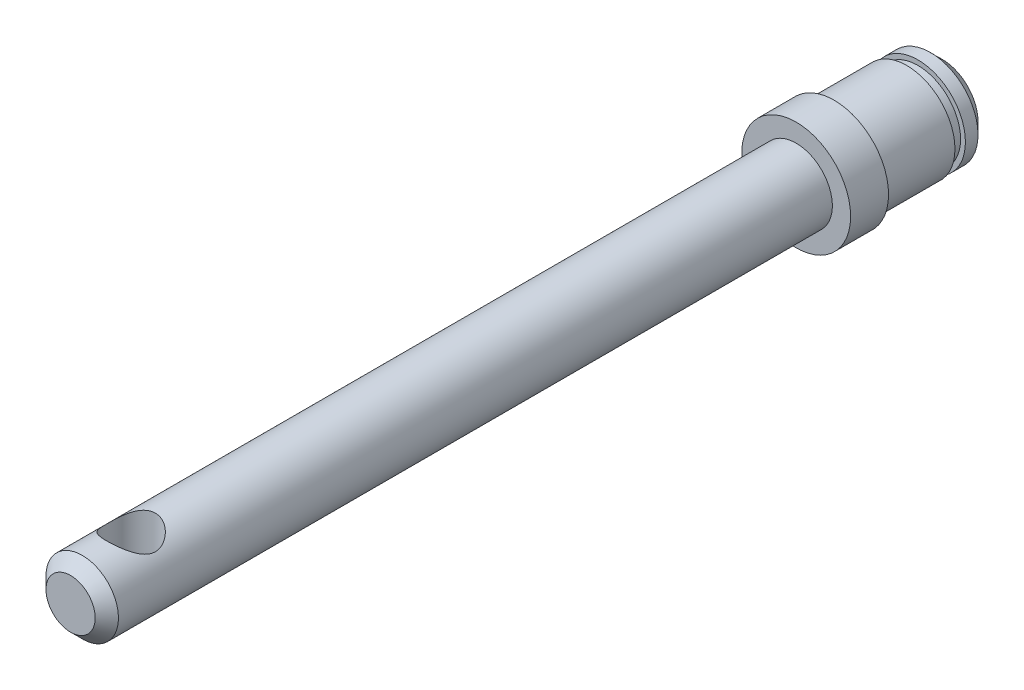
ISO-10303-21;
HEADER;
FILE_DESCRIPTION(('STEP AP214'),'2;1');
FILE_NAME('part.step','',(''),(''),'','','');
FILE_SCHEMA(('AUTOMOTIVE_DESIGN { 1 0 10303 214 1 1 1 1 }'));
ENDSEC;
DATA;
#1=APPLICATION_CONTEXT('core data for automotive mechanical design processes');
#2=APPLICATION_PROTOCOL_DEFINITION('international standard','automotive_design',2000,#1);
#3=PRODUCT_CONTEXT('',#1,'mechanical');
#4=PRODUCT('Part','Part','',(#3));
#5=PRODUCT_RELATED_PRODUCT_CATEGORY('part','',(#4));
#6=PRODUCT_DEFINITION_FORMATION('','',#4);
#7=PRODUCT_DEFINITION_CONTEXT('part definition',#1,'design');
#8=PRODUCT_DEFINITION('design','',#6,#7);
#9=PRODUCT_DEFINITION_SHAPE('','',#8);
#10=(LENGTH_UNIT() NAMED_UNIT(*) SI_UNIT(.MILLI.,.METRE.));
#11=(NAMED_UNIT(*) PLANE_ANGLE_UNIT() SI_UNIT($,.RADIAN.));
#12=(NAMED_UNIT(*) SI_UNIT($,.STERADIAN.) SOLID_ANGLE_UNIT());
#13=UNCERTAINTY_MEASURE_WITH_UNIT(LENGTH_MEASURE(1.E-05),#10,'distance_accuracy_value','');
#14=(GEOMETRIC_REPRESENTATION_CONTEXT(3) GLOBAL_UNCERTAINTY_ASSIGNED_CONTEXT((#13)) GLOBAL_UNIT_ASSIGNED_CONTEXT((#10,
#11,#12)) REPRESENTATION_CONTEXT('',''));
#15=CARTESIAN_POINT('',(0.,0.,0.));
#16=DIRECTION('',(0.,0.,1.));
#17=DIRECTION('',(1.,0.,0.));
#18=AXIS2_PLACEMENT_3D('',#15,#16,#17);
#19=CARTESIAN_POINT('',(0.,0.,-9.5758));
#20=DIRECTION('',(0.,0.,-1.));
#21=DIRECTION('',(-1.,0.,0.));
#22=AXIS2_PLACEMENT_3D('',#19,#20,#21);
#23=PLANE('',#22);
#24=CARTESIAN_POINT('',(0.,0.,-9.57579999993641));
#25=DIRECTION('',(0.,0.,1.));
#26=DIRECTION('',(1.,0.,0.));
#27=AXIS2_PLACEMENT_3D('',#24,#25,#26);
#28=CIRCLE('',#27,2.3494999999798);
#29=CARTESIAN_POINT('',(2.3494999999798,0.,-9.57579999993641));
#30=VERTEX_POINT('',#29);
#31=EDGE_CURVE('E17',#30,#30,#28,.T.);
#32=ORIENTED_EDGE('',*,*,#31,.F.);
#33=EDGE_LOOP('',(#32));
#34=FACE_BOUND('',#33,.T.);
#35=ADVANCED_FACE('F14',(#34),#23,.T.);
#36=CARTESIAN_POINT('',(0.,0.,-8.81380000009813));
#37=DIRECTION('',(0.,0.,1.));
#38=DIRECTION('',(1.,0.,0.));
#39=AXIS2_PLACEMENT_3D('',#36,#37,#38);
#40=CONICAL_SURFACE('',#39,3.11149999987492,0.785398163434747);
#41=ORIENTED_EDGE('',*,*,#31,.T.);
#42=EDGE_LOOP('',(#41));
#43=FACE_BOUND('',#42,.T.);
#44=CARTESIAN_POINT('',(0.,0.,-8.8138));
#45=DIRECTION('',(0.,0.,1.));
#46=DIRECTION('',(1.,0.,0.));
#47=AXIS2_PLACEMENT_3D('',#44,#45,#46);
#48=CIRCLE('',#47,3.1115);
#49=CARTESIAN_POINT('',(3.1115,0.,-8.8138));
#50=VERTEX_POINT('',#49);
#51=EDGE_CURVE('E33',#50,#50,#48,.T.);
#52=ORIENTED_EDGE('',*,*,#51,.F.);
#53=EDGE_LOOP('',(#52));
#54=FACE_BOUND('',#53,.T.);
#55=ADVANCED_FACE('F79',(#43,#54),#40,.T.);
#56=CARTESIAN_POINT('',(0.,0.,-9.5758));
#57=DIRECTION('',(0.,0.,1.));
#58=DIRECTION('',(1.,0.,0.));
#59=AXIS2_PLACEMENT_3D('',#56,#57,#58);
#60=CYLINDRICAL_SURFACE('',#59,3.1115);
#61=ORIENTED_EDGE('',*,*,#51,.T.);
#62=EDGE_LOOP('',(#61));
#63=FACE_BOUND('',#62,.T.);
#64=CARTESIAN_POINT('',(0.,0.,-7.9883));
#65=DIRECTION('',(0.,0.,1.));
#66=DIRECTION('',(1.,0.,0.));
#67=AXIS2_PLACEMENT_3D('',#64,#65,#66);
#68=CIRCLE('',#67,3.1115);
#69=CARTESIAN_POINT('',(3.1115,0.,-7.9883));
#70=VERTEX_POINT('',#69);
#71=EDGE_CURVE('E69',#70,#70,#68,.F.);
#72=ORIENTED_EDGE('',*,*,#71,.T.);
#73=EDGE_LOOP('',(#72));
#74=FACE_BOUND('',#73,.T.);
#75=ADVANCED_FACE('F87',(#63,#74),#60,.T.);
#76=CARTESIAN_POINT('',(0.,0.,-7.9883));
#77=DIRECTION('',(0.,0.,-1.));
#78=DIRECTION('',(-1.,0.,0.));
#79=AXIS2_PLACEMENT_3D('',#76,#77,#78);
#80=PLANE('',#79);
#81=CARTESIAN_POINT('',(0.,0.,-7.9883));
#82=DIRECTION('',(0.,0.,1.));
#83=DIRECTION('',(1.,0.,0.));
#84=AXIS2_PLACEMENT_3D('',#81,#82,#83);
#85=CIRCLE('',#84,2.794);
#86=CARTESIAN_POINT('',(2.794,0.,-7.9883));
#87=VERTEX_POINT('',#86);
#88=EDGE_CURVE('E67',#87,#87,#85,.T.);
#89=ORIENTED_EDGE('',*,*,#88,.F.);
#90=EDGE_LOOP('',(#89));
#91=FACE_BOUND('',#90,.T.);
#92=ORIENTED_EDGE('',*,*,#71,.F.);
#93=EDGE_LOOP('',(#92));
#94=FACE_BOUND('',#93,.T.);
#95=ADVANCED_FACE('F92',(#91,#94),#80,.F.);
#96=CARTESIAN_POINT('',(0.,0.,-7.9883));
#97=DIRECTION('',(0.,0.,1.));
#98=DIRECTION('',(1.,0.,0.));
#99=AXIS2_PLACEMENT_3D('',#96,#97,#98);
#100=CYLINDRICAL_SURFACE('',#99,2.794);
#101=CARTESIAN_POINT('',(0.,0.,-7.2517));
#102=DIRECTION('',(0.,0.,1.));
#103=DIRECTION('',(1.,0.,0.));
#104=AXIS2_PLACEMENT_3D('',#101,#102,#103);
#105=CIRCLE('',#104,2.794);
#106=CARTESIAN_POINT('',(2.794,0.,-7.2517));
#107=VERTEX_POINT('',#106);
#108=EDGE_CURVE('E64',#107,#107,#105,.T.);
#109=ORIENTED_EDGE('',*,*,#108,.F.);
#110=EDGE_LOOP('',(#109));
#111=FACE_BOUND('',#110,.T.);
#112=ORIENTED_EDGE('',*,*,#88,.T.);
#113=EDGE_LOOP('',(#112));
#114=FACE_BOUND('',#113,.T.);
#115=ADVANCED_FACE('F97',(#111,#114),#100,.T.);
#116=CARTESIAN_POINT('',(0.,0.,-7.2517));
#117=DIRECTION('',(0.,0.,-1.));
#118=DIRECTION('',(-1.,0.,0.));
#119=AXIS2_PLACEMENT_3D('',#116,#117,#118);
#120=PLANE('',#119);
#121=ORIENTED_EDGE('',*,*,#108,.T.);
#122=EDGE_LOOP('',(#121));
#123=FACE_BOUND('',#122,.T.);
#124=CARTESIAN_POINT('',(0.,0.,-7.2517));
#125=DIRECTION('',(0.,0.,1.));
#126=DIRECTION('',(1.,0.,0.));
#127=AXIS2_PLACEMENT_3D('',#124,#125,#126);
#128=CIRCLE('',#127,3.1623);
#129=CARTESIAN_POINT('',(3.1623,0.,-7.2517));
#130=VERTEX_POINT('',#129);
#131=EDGE_CURVE('E61',#130,#130,#128,.T.);
#132=ORIENTED_EDGE('',*,*,#131,.F.);
#133=EDGE_LOOP('',(#132));
#134=FACE_BOUND('',#133,.T.);
#135=ADVANCED_FACE('F101',(#123,#134),#120,.T.);
#136=CARTESIAN_POINT('',(0.,0.,-7.2517));
#137=DIRECTION('',(0.,0.,1.));
#138=DIRECTION('',(1.,0.,0.));
#139=AXIS2_PLACEMENT_3D('',#136,#137,#138);
#140=CYLINDRICAL_SURFACE('',#139,3.1623);
#141=ORIENTED_EDGE('',*,*,#131,.T.);
#142=EDGE_LOOP('',(#141));
#143=FACE_BOUND('',#142,.T.);
#144=CARTESIAN_POINT('',(0.,0.,-2.4892));
#145=DIRECTION('',(0.,0.,1.));
#146=DIRECTION('',(1.,0.,0.));
#147=AXIS2_PLACEMENT_3D('',#144,#145,#146);
#148=CIRCLE('',#147,3.1623);
#149=CARTESIAN_POINT('',(3.1623,0.,-2.4892));
#150=VERTEX_POINT('',#149);
#151=EDGE_CURVE('E58',#150,#150,#148,.F.);
#152=ORIENTED_EDGE('',*,*,#151,.T.);
#153=EDGE_LOOP('',(#152));
#154=FACE_BOUND('',#153,.T.);
#155=ADVANCED_FACE('F105',(#143,#154),#140,.T.);
#156=CARTESIAN_POINT('',(0.,0.,-2.4892));
#157=DIRECTION('',(0.,0.,1.));
#158=DIRECTION('',(1.,0.,0.));
#159=AXIS2_PLACEMENT_3D('',#156,#157,#158);
#160=PLANE('',#159);
#161=ORIENTED_EDGE('',*,*,#151,.F.);
#162=EDGE_LOOP('',(#161));
#163=FACE_BOUND('',#162,.T.);
#164=CARTESIAN_POINT('',(0.,0.,-2.4892));
#165=DIRECTION('',(0.,0.,1.));
#166=DIRECTION('',(1.,0.,0.));
#167=AXIS2_PLACEMENT_3D('',#164,#165,#166);
#168=CIRCLE('',#167,3.571875);
#169=CARTESIAN_POINT('',(3.571875,0.,-2.4892));
#170=VERTEX_POINT('',#169);
#171=EDGE_CURVE('E55',#170,#170,#168,.T.);
#172=ORIENTED_EDGE('',*,*,#171,.F.);
#173=EDGE_LOOP('',(#172));
#174=FACE_BOUND('',#173,.T.);
#175=ADVANCED_FACE('F109',(#163,#174),#160,.F.);
#176=CARTESIAN_POINT('',(0.,0.,47.5742));
#177=DIRECTION('',(0.,0.,1.));
#178=DIRECTION('',(1.,0.,0.));
#179=AXIS2_PLACEMENT_3D('',#176,#177,#178);
#180=PLANE('',#179);
#181=CARTESIAN_POINT('',(0.,0.,47.5741999999855));
#182=DIRECTION('',(0.,0.,-1.));
#183=DIRECTION('',(-1.,0.,0.));
#184=AXIS2_PLACEMENT_3D('',#181,#182,#183);
#185=CIRCLE('',#184,1.61289999999781);
#186=CARTESIAN_POINT('',(-1.61289999999781,0.,47.5741999999855));
#187=VERTEX_POINT('',#186);
#188=EDGE_CURVE('E52',#187,#187,#185,.T.);
#189=ORIENTED_EDGE('',*,*,#188,.F.);
#190=EDGE_LOOP('',(#189));
#191=FACE_BOUND('',#190,.T.);
#192=ADVANCED_FACE('F113',(#191),#180,.T.);
#193=CARTESIAN_POINT('',(0.,0.,-2.4892));
#194=DIRECTION('',(0.,0.,1.));
#195=DIRECTION('',(1.,0.,0.));
#196=AXIS2_PLACEMENT_3D('',#193,#194,#195);
#197=CYLINDRICAL_SURFACE('',#196,3.571875);
#198=ORIENTED_EDGE('',*,*,#171,.T.);
#199=EDGE_LOOP('',(#198));
#200=FACE_BOUND('',#199,.T.);
#201=CARTESIAN_POINT('',(0.,0.,0.));
#202=DIRECTION('',(0.,0.,1.));
#203=DIRECTION('',(1.,0.,0.));
#204=AXIS2_PLACEMENT_3D('',#201,#202,#203);
#205=CIRCLE('',#204,3.571875);
#206=CARTESIAN_POINT('',(3.571875,0.,0.));
#207=VERTEX_POINT('',#206);
#208=EDGE_CURVE('E49',#207,#207,#205,.T.);
#209=ORIENTED_EDGE('',*,*,#208,.F.);
#210=EDGE_LOOP('',(#209));
#211=FACE_BOUND('',#210,.T.);
#212=ADVANCED_FACE('F117',(#200,#211),#197,.T.);
#213=CARTESIAN_POINT('',(0.,0.,46.8121999999767));
#214=DIRECTION('',(0.,0.,-1.));
#215=DIRECTION('',(-1.,0.,0.));
#216=AXIS2_PLACEMENT_3D('',#213,#214,#215);
#217=CONICAL_SURFACE('',#216,2.37490000000662,0.785398163397448);
#218=ORIENTED_EDGE('',*,*,#188,.T.);
#219=EDGE_LOOP('',(#218));
#220=FACE_BOUND('',#219,.T.);
#221=CARTESIAN_POINT('',(0.,0.,46.8122));
#222=DIRECTION('',(0.,0.,-1.));
#223=DIRECTION('',(-1.,0.,0.));
#224=AXIS2_PLACEMENT_3D('',#221,#222,#223);
#225=CIRCLE('',#224,2.3749);
#226=CARTESIAN_POINT('',(-2.3749,0.,46.8122));
#227=VERTEX_POINT('',#226);
#228=EDGE_CURVE('E26',#227,#227,#225,.T.);
#229=ORIENTED_EDGE('',*,*,#228,.F.);
#230=EDGE_LOOP('',(#229));
#231=FACE_BOUND('',#230,.T.);
#232=ADVANCED_FACE('F121',(#220,#231),#217,.T.);
#233=CARTESIAN_POINT('',(0.,0.,0.));
#234=DIRECTION('',(0.,0.,1.));
#235=DIRECTION('',(1.,0.,0.));
#236=AXIS2_PLACEMENT_3D('',#233,#234,#235);
#237=PLANE('',#236);
#238=CARTESIAN_POINT('',(0.,0.,0.));
#239=DIRECTION('',(0.,0.,-1.));
#240=DIRECTION('',(-1.,0.,0.));
#241=AXIS2_PLACEMENT_3D('',#238,#239,#240);
#242=CIRCLE('',#241,2.3749);
#243=CARTESIAN_POINT('',(-2.3749,0.,0.));
#244=VERTEX_POINT('',#243);
#245=EDGE_CURVE('E21',#244,#244,#242,.F.);
#246=ORIENTED_EDGE('',*,*,#245,.F.);
#247=EDGE_LOOP('',(#246));
#248=FACE_BOUND('',#247,.T.);
#249=ORIENTED_EDGE('',*,*,#208,.T.);
#250=EDGE_LOOP('',(#249));
#251=FACE_BOUND('',#250,.T.);
#252=ADVANCED_FACE('F124',(#248,#251),#237,.T.);
#253=CARTESIAN_POINT('',(0.,-3.571875,43.60545));
#254=DIRECTION('',(0.,1.,0.));
#255=DIRECTION('',(0.,0.,1.));
#256=AXIS2_PLACEMENT_3D('',#253,#254,#255);
#257=CYLINDRICAL_SURFACE('',#256,1.5875);
#258=CARTESIAN_POINT('',(0.,2.3749,45.19295));
#259=CARTESIAN_POINT('',(-0.0796285021727966,2.37489427166207,45.1929439134093));
#260=CARTESIAN_POINT('',(-0.159333187346092,2.3708547437601,45.1869178453679));
#261=CARTESIAN_POINT('',(-0.316246788253907,2.35507625489168,45.1631617849446));
#262=CARTESIAN_POINT('',(-0.393451638249593,2.34332535323937,45.1454136412255));
#263=CARTESIAN_POINT('',(-0.542790518515763,2.31328830758023,45.0993083312295));
#264=CARTESIAN_POINT('',(-0.614948378456795,2.29503576257873,45.0710056736267));
#265=CARTESIAN_POINT('',(-0.753178545236462,2.25346165524091,45.0050040485006));
#266=CARTESIAN_POINT('',(-0.819251194999285,2.23014037879558,44.9673056109087));
#267=CARTESIAN_POINT('',(-0.949807131451189,2.17792784028168,44.8800881288627));
#268=CARTESIAN_POINT('',(-1.01367601133952,2.14873138397025,44.8298358883516));
#269=CARTESIAN_POINT('',(-1.13266066753279,2.0884656766868,44.7206931180195));
#270=CARTESIAN_POINT('',(-1.18776336726205,2.05739372150985,44.6617899306125));
#271=CARTESIAN_POINT('',(-1.29659427145063,1.99089626995362,44.5261680967343));
#272=CARTESIAN_POINT('',(-1.34871636553572,1.95556248733199,44.4481056626616));
#273=CARTESIAN_POINT('',(-1.43904349853149,1.89008374794265,44.2823403381314));
#274=CARTESIAN_POINT('',(-1.4772725865024,1.85992987284409,44.1946544520516));
#275=CARTESIAN_POINT('',(-1.52904517834333,1.81740283377534,44.0377472795276));
#276=CARTESIAN_POINT('',(-1.54653236351236,1.80240921282223,43.9705447171603));
#277=CARTESIAN_POINT('',(-1.57261168441343,1.77970474695812,43.8332848433952));
#278=CARTESIAN_POINT('',(-1.58121930044462,1.7719812296935,43.763232722255));
#279=CARTESIAN_POINT('',(-1.58899802612375,1.76501215254764,43.6218716388384));
#280=CARTESIAN_POINT('',(-1.58812985724121,1.76580188116326,43.5505586693621));
#281=CARTESIAN_POINT('',(-1.57692650593038,1.77581049841768,43.4092572197684));
#282=CARTESIAN_POINT('',(-1.56658327442516,1.7850365537139,43.3392699174096));
#283=CARTESIAN_POINT('',(-1.53778680769931,1.80988877384798,43.2056567626746));
#284=CARTESIAN_POINT('',(-1.51972103829905,1.82520699487101,43.1418863605764));
#285=CARTESIAN_POINT('',(-1.47635800673587,1.86045582345457,43.0182351850859));
#286=CARTESIAN_POINT('',(-1.45105836975688,1.88038794530891,42.9583556969829));
#287=CARTESIAN_POINT('',(-1.38804369169894,1.92751840139636,42.8311724358925));
#288=CARTESIAN_POINT('',(-1.34884877883874,1.95536954816995,42.7648460457442));
#289=CARTESIAN_POINT('',(-1.26169992826936,2.01270750683002,42.6389401049234));
#290=CARTESIAN_POINT('',(-1.21373539144903,2.04219626760565,42.5793688613398));
#291=CARTESIAN_POINT('',(-1.09822042057742,2.10697571698643,42.4553504562286));
#292=CARTESIAN_POINT('',(-1.02867941502371,2.14213147691545,42.3926663982129));
#293=CARTESIAN_POINT('',(-0.87829590652397,2.20804612806214,42.2797162875604));
#294=CARTESIAN_POINT('',(-0.797461070213304,2.23880797360637,42.2294418743602));
#295=CARTESIAN_POINT('',(-0.642794196366182,2.28740091649053,42.151857840345));
#296=CARTESIAN_POINT('',(-0.570673934887535,2.30658392602361,42.1219812810788));
#297=CARTESIAN_POINT('',(-0.421590346714549,2.33841465201831,42.0729550712348));
#298=CARTESIAN_POINT('',(-0.344638477425361,2.35107721947041,42.05378103609));
#299=CARTESIAN_POINT('',(-0.222529004084351,2.36486476954346,42.0329936390966));
#300=CARTESIAN_POINT('',(-0.178308116016056,2.36861511899109,42.0273651451537));
#301=CARTESIAN_POINT('',(-0.0893995612791168,2.37363462559172,42.0198411908061));
#302=CARTESIAN_POINT('',(-0.0447117904210668,2.37490321648955,42.0179465823498));
#303=CARTESIAN_POINT('',(0.0796285021727959,2.37489427166207,42.0179560865907));
#304=CARTESIAN_POINT('',(0.159333187346092,2.3708547437601,42.0239821546321));
#305=CARTESIAN_POINT('',(0.316246788253906,2.35507625489168,42.0477382150553));
#306=CARTESIAN_POINT('',(0.393451638249593,2.34332535323937,42.0654863587745));
#307=CARTESIAN_POINT('',(0.542790518515763,2.31328830758023,42.1115916687705));
#308=CARTESIAN_POINT('',(0.614948378456795,2.29503576257873,42.1398943263733));
#309=CARTESIAN_POINT('',(0.753178545236463,2.25346165524091,42.2058959514994));
#310=CARTESIAN_POINT('',(0.819251194999285,2.23014037879558,42.2435943890913));
#311=CARTESIAN_POINT('',(0.949807131451189,2.17792784028168,42.3308118711373));
#312=CARTESIAN_POINT('',(1.01367601133952,2.14873138397025,42.3810641116484));
#313=CARTESIAN_POINT('',(1.13266066753279,2.0884656766868,42.4902068819805));
#314=CARTESIAN_POINT('',(1.18776336726205,2.05739372150985,42.5491100693874));
#315=CARTESIAN_POINT('',(1.29659427145063,1.99089626995362,42.6847319032657));
#316=CARTESIAN_POINT('',(1.34871636553572,1.95556248733199,42.7627943373384));
#317=CARTESIAN_POINT('',(1.43904349853149,1.89008374794265,42.9285596618686));
#318=CARTESIAN_POINT('',(1.4772725865024,1.85992987284409,43.0162455479484));
#319=CARTESIAN_POINT('',(1.52904517834333,1.81740283377534,43.1731527204724));
#320=CARTESIAN_POINT('',(1.54653236351236,1.80240921282223,43.2403552828397));
#321=CARTESIAN_POINT('',(1.57261168441343,1.77970474695812,43.3776151566048));
#322=CARTESIAN_POINT('',(1.58121930044462,1.7719812296935,43.447667277745));
#323=CARTESIAN_POINT('',(1.58899802612375,1.76501215254764,43.5890283611616));
#324=CARTESIAN_POINT('',(1.58812985724121,1.76580188116326,43.6603413306379));
#325=CARTESIAN_POINT('',(1.57692650593038,1.77581049841768,43.8016427802316));
#326=CARTESIAN_POINT('',(1.56658327442517,1.7850365537139,43.8716300825904));
#327=CARTESIAN_POINT('',(1.53778680769931,1.80988877384798,44.0052432373254));
#328=CARTESIAN_POINT('',(1.51972103829905,1.825206994871,44.0690136394236));
#329=CARTESIAN_POINT('',(1.47635800673587,1.86045582345457,44.192664814914));
#330=CARTESIAN_POINT('',(1.45105836975689,1.88038794530891,44.2525443030171));
#331=CARTESIAN_POINT('',(1.38804369169894,1.92751840139636,44.3797275641075));
#332=CARTESIAN_POINT('',(1.34884877883874,1.95536954816995,44.4460539542558));
#333=CARTESIAN_POINT('',(1.26169992826936,2.01270750683002,44.5719598950766));
#334=CARTESIAN_POINT('',(1.21373539144903,2.04219626760564,44.6315311386602));
#335=CARTESIAN_POINT('',(1.09822042057742,2.10697571698643,44.7555495437714));
#336=CARTESIAN_POINT('',(1.02867941502371,2.14213147691544,44.8182336017871));
#337=CARTESIAN_POINT('',(0.87829590652398,2.20804612806214,44.9311837124396));
#338=CARTESIAN_POINT('',(0.797461070213316,2.23880797360636,44.9814581256398));
#339=CARTESIAN_POINT('',(0.642794196366197,2.28740091649053,45.059042159655));
#340=CARTESIAN_POINT('',(0.57067393488755,2.30658392602361,45.0889187189212));
#341=CARTESIAN_POINT('',(0.421590346714565,2.33841465201831,45.1379449287651));
#342=CARTESIAN_POINT('',(0.344638477425378,2.3510772194704,45.15711896391));
#343=CARTESIAN_POINT('',(0.222529004084365,2.36486476954346,45.1779063609034));
#344=CARTESIAN_POINT('',(0.178308116016067,2.36861511899109,45.1835348548463));
#345=CARTESIAN_POINT('',(0.0893995612791212,2.37363462559172,45.1910588091939));
#346=CARTESIAN_POINT('',(0.0447117904210687,2.37490321648955,45.1929534176502));
#347=CARTESIAN_POINT('',(0.,2.3749,45.19295));
#348=B_SPLINE_CURVE_WITH_KNOTS('',3,(#258,#259,#260,#261,#262,#263,#264,#265,#266,#267,#268,
#269,#270,#271,#272,#273,#274,#275,#276,#277,#278,#279,#280,#281,#282,#283,#284,#285,#286,#287,
#288,#289,#290,#291,#292,#293,#294,#295,#296,#297,#298,#299,#300,#301,#302,#303,#304,#305,#306,
#307,#308,#309,#310,#311,#312,#313,#314,#315,#316,#317,#318,#319,#320,#321,#322,#323,#324,#325,
#326,#327,#328,#329,#330,#331,#332,#333,#334,#335,#336,#337,#338,#339,#340,#341,#342,#343,#344,
#345,#346,#347),.UNSPECIFIED.,.T.,.F.,(4,2,2,2,2,2,2,2,2,2,2,2,2,2,2,2,2,2,2,2,2,2,2,2,2,2,2,2,
2,2,2,2,2,2,2,2,2,2,2,2,2,2,2,2,4),(0.,0.238700395852421,0.477771282535445,0.71562421428543,
0.95346373392742,1.21155549797826,1.47002872073382,1.76952408912618,2.06849852769238,
2.28077891750231,2.49268859719911,2.70547700634111,2.9184463472867,3.12179507761272,
3.32521064236503,3.57012288877609,3.815333120713,4.1139409115089,4.41234697329097,
4.65252034508975,4.89214425005817,5.02614510978654,5.16017654051243,5.39887693636485,
5.63794782304788,5.87580075479786,6.11364027443985,6.37173203849069,6.63020526124625,
6.92970062963861,7.22867506820481,7.44095545801474,7.65286513771153,7.86565354685354,
8.07862288779913,8.28197161812515,8.48538718287745,8.73029942928851,8.97550966122542,
9.27411745202132,9.57252351380338,9.81269688560216,10.0523207905706,10.186321650299,
10.3203530810249),.UNSPECIFIED.);
#349=CARTESIAN_POINT('',(0.,2.3749,45.19295));
#350=VERTEX_POINT('',#349);
#351=EDGE_CURVE('E44',#350,#350,#348,.T.);
#352=ORIENTED_EDGE('',*,*,#351,.F.);
#353=EDGE_LOOP('',(#352));
#354=FACE_BOUND('',#353,.T.);
#355=CARTESIAN_POINT('',(0.,-2.3749,45.19295));
#356=CARTESIAN_POINT('',(0.079628502172797,-2.37489427166208,45.1929439134093));
#357=CARTESIAN_POINT('',(0.159333187346093,-2.3708547437601,45.1869178453679));
#358=CARTESIAN_POINT('',(0.316246788253907,-2.35507625489168,45.1631617849446));
#359=CARTESIAN_POINT('',(0.393451638249594,-2.34332535323937,45.1454136412255));
#360=CARTESIAN_POINT('',(0.542790518515763,-2.31328830758023,45.0993083312295));
#361=CARTESIAN_POINT('',(0.614948378456796,-2.29503576257873,45.0710056736267));
#362=CARTESIAN_POINT('',(0.753178545236462,-2.25346165524091,45.0050040485006));
#363=CARTESIAN_POINT('',(0.819251194999285,-2.23014037879558,44.9673056109087));
#364=CARTESIAN_POINT('',(0.949807131451189,-2.17792784028168,44.8800881288627));
#365=CARTESIAN_POINT('',(1.01367601133952,-2.14873138397025,44.8298358883516));
#366=CARTESIAN_POINT('',(1.13266066753279,-2.0884656766868,44.7206931180195));
#367=CARTESIAN_POINT('',(1.18776336726205,-2.05739372150985,44.6617899306125));
#368=CARTESIAN_POINT('',(1.29659427145063,-1.99089626995362,44.5261680967343));
#369=CARTESIAN_POINT('',(1.34871636553572,-1.95556248733199,44.4481056626616));
#370=CARTESIAN_POINT('',(1.43904349853149,-1.89008374794265,44.2823403381314));
#371=CARTESIAN_POINT('',(1.4772725865024,-1.85992987284409,44.1946544520516));
#372=CARTESIAN_POINT('',(1.52904517834333,-1.81740283377534,44.0377472795276));
#373=CARTESIAN_POINT('',(1.54653236351237,-1.80240921282223,43.9705447171602));
#374=CARTESIAN_POINT('',(1.57261168441344,-1.77970474695812,43.8332848433952));
#375=CARTESIAN_POINT('',(1.58121930044462,-1.7719812296935,43.763232722255));
#376=CARTESIAN_POINT('',(1.58899802612375,-1.76501215254764,43.6218716388384));
#377=CARTESIAN_POINT('',(1.58812985724121,-1.76580188116326,43.5505586693621));
#378=CARTESIAN_POINT('',(1.57692650593038,-1.77581049841768,43.4092572197684));
#379=CARTESIAN_POINT('',(1.56658327442516,-1.7850365537139,43.3392699174096));
#380=CARTESIAN_POINT('',(1.53778680769931,-1.80988877384798,43.2056567626746));
#381=CARTESIAN_POINT('',(1.51972103829905,-1.82520699487101,43.1418863605764));
#382=CARTESIAN_POINT('',(1.47635800673587,-1.86045582345457,43.0182351850859));
#383=CARTESIAN_POINT('',(1.45105836975688,-1.88038794530891,42.9583556969829));
#384=CARTESIAN_POINT('',(1.38804369169894,-1.92751840139636,42.8311724358925));
#385=CARTESIAN_POINT('',(1.34884877883874,-1.95536954816995,42.7648460457442));
#386=CARTESIAN_POINT('',(1.26169992826936,-2.01270750683002,42.6389401049234));
#387=CARTESIAN_POINT('',(1.21373539144903,-2.04219626760565,42.5793688613398));
#388=CARTESIAN_POINT('',(1.09822042057742,-2.10697571698643,42.4553504562286));
#389=CARTESIAN_POINT('',(1.0286794150237,-2.14213147691545,42.3926663982129));
#390=CARTESIAN_POINT('',(0.878295906523966,-2.20804612806214,42.2797162875604));
#391=CARTESIAN_POINT('',(0.797461070213302,-2.23880797360637,42.2294418743602));
#392=CARTESIAN_POINT('',(0.642794196366183,-2.28740091649053,42.151857840345));
#393=CARTESIAN_POINT('',(0.570673934887537,-2.30658392602361,42.1219812810788));
#394=CARTESIAN_POINT('',(0.421590346714551,-2.33841465201831,42.0729550712348));
#395=CARTESIAN_POINT('',(0.344638477425362,-2.35107721947041,42.05378103609));
#396=CARTESIAN_POINT('',(0.22252900408435,-2.36486476954346,42.0329936390966));
#397=CARTESIAN_POINT('',(0.178308116016056,-2.36861511899109,42.0273651451537));
#398=CARTESIAN_POINT('',(0.0893995612791169,-2.37363462559172,42.0198411908061));
#399=CARTESIAN_POINT('',(0.0447117904210671,-2.37490321648955,42.0179465823498));
#400=CARTESIAN_POINT('',(-0.0796285021727957,-2.37489427166208,42.0179560865907));
#401=CARTESIAN_POINT('',(-0.159333187346092,-2.3708547437601,42.0239821546321));
#402=CARTESIAN_POINT('',(-0.316246788253906,-2.35507625489168,42.0477382150553));
#403=CARTESIAN_POINT('',(-0.393451638249593,-2.34332535323937,42.0654863587745));
#404=CARTESIAN_POINT('',(-0.542790518515762,-2.31328830758023,42.1115916687705));
#405=CARTESIAN_POINT('',(-0.614948378456795,-2.29503576257873,42.1398943263733));
#406=CARTESIAN_POINT('',(-0.753178545236462,-2.25346165524091,42.2058959514994));
#407=CARTESIAN_POINT('',(-0.819251194999284,-2.23014037879558,42.2435943890913));
#408=CARTESIAN_POINT('',(-0.949807131451189,-2.17792784028168,42.3308118711373));
#409=CARTESIAN_POINT('',(-1.01367601133952,-2.14873138397025,42.3810641116484));
#410=CARTESIAN_POINT('',(-1.13266066753279,-2.0884656766868,42.4902068819805));
#411=CARTESIAN_POINT('',(-1.18776336726205,-2.05739372150985,42.5491100693874));
#412=CARTESIAN_POINT('',(-1.29659427145063,-1.99089626995362,42.6847319032657));
#413=CARTESIAN_POINT('',(-1.34871636553572,-1.95556248733199,42.7627943373384));
#414=CARTESIAN_POINT('',(-1.43904349853149,-1.89008374794265,42.9285596618686));
#415=CARTESIAN_POINT('',(-1.4772725865024,-1.85992987284409,43.0162455479484));
#416=CARTESIAN_POINT('',(-1.52904517834333,-1.81740283377534,43.1731527204724));
#417=CARTESIAN_POINT('',(-1.54653236351237,-1.80240921282223,43.2403552828398));
#418=CARTESIAN_POINT('',(-1.57261168441344,-1.77970474695812,43.3776151566048));
#419=CARTESIAN_POINT('',(-1.58121930044462,-1.7719812296935,43.447667277745));
#420=CARTESIAN_POINT('',(-1.58899802612375,-1.76501215254764,43.5890283611616));
#421=CARTESIAN_POINT('',(-1.58812985724121,-1.76580188116326,43.6603413306379));
#422=CARTESIAN_POINT('',(-1.57692650593038,-1.77581049841768,43.8016427802316));
#423=CARTESIAN_POINT('',(-1.56658327442516,-1.7850365537139,43.8716300825904));
#424=CARTESIAN_POINT('',(-1.53778680769931,-1.80988877384798,44.0052432373254));
#425=CARTESIAN_POINT('',(-1.51972103829905,-1.82520699487101,44.0690136394236));
#426=CARTESIAN_POINT('',(-1.47635800673587,-1.86045582345457,44.192664814914));
#427=CARTESIAN_POINT('',(-1.45105836975688,-1.88038794530891,44.2525443030171));
#428=CARTESIAN_POINT('',(-1.38804369169894,-1.92751840139636,44.3797275641075));
#429=CARTESIAN_POINT('',(-1.34884877883874,-1.95536954816995,44.4460539542558));
#430=CARTESIAN_POINT('',(-1.26169992826936,-2.01270750683002,44.5719598950766));
#431=CARTESIAN_POINT('',(-1.21373539144903,-2.04219626760565,44.6315311386602));
#432=CARTESIAN_POINT('',(-1.09822042057742,-2.10697571698643,44.7555495437714));
#433=CARTESIAN_POINT('',(-1.02867941502371,-2.14213147691544,44.8182336017871));
#434=CARTESIAN_POINT('',(-0.878295906523972,-2.20804612806214,44.9311837124396));
#435=CARTESIAN_POINT('',(-0.797461070213305,-2.23880797360637,44.9814581256398));
#436=CARTESIAN_POINT('',(-0.642794196366183,-2.28740091649053,45.059042159655));
#437=CARTESIAN_POINT('',(-0.570673934887537,-2.30658392602361,45.0889187189212));
#438=CARTESIAN_POINT('',(-0.421590346714551,-2.33841465201831,45.1379449287651));
#439=CARTESIAN_POINT('',(-0.344638477425362,-2.35107721947041,45.15711896391));
#440=CARTESIAN_POINT('',(-0.22252900408435,-2.36486476954346,45.1779063609034));
#441=CARTESIAN_POINT('',(-0.178308116016055,-2.36861511899109,45.1835348548463));
#442=CARTESIAN_POINT('',(-0.0893995612791154,-2.37363462559172,45.1910588091939));
#443=CARTESIAN_POINT('',(-0.0447117904210655,-2.37490321648955,45.1929534176502));
#444=CARTESIAN_POINT('',(0.,-2.3749,45.19295));
#445=B_SPLINE_CURVE_WITH_KNOTS('',3,(#355,#356,#357,#358,#359,#360,#361,#362,#363,#364,#365,
#366,#367,#368,#369,#370,#371,#372,#373,#374,#375,#376,#377,#378,#379,#380,#381,#382,#383,#384,
#385,#386,#387,#388,#389,#390,#391,#392,#393,#394,#395,#396,#397,#398,#399,#400,#401,#402,#403,
#404,#405,#406,#407,#408,#409,#410,#411,#412,#413,#414,#415,#416,#417,#418,#419,#420,#421,#422,
#423,#424,#425,#426,#427,#428,#429,#430,#431,#432,#433,#434,#435,#436,#437,#438,#439,#440,#441,
#442,#443,#444),.UNSPECIFIED.,.T.,.F.,(4,2,2,2,2,2,2,2,2,2,2,2,2,2,2,2,2,2,2,2,2,2,2,2,2,2,2,2,
2,2,2,2,2,2,2,2,2,2,2,2,2,2,2,2,4),(0.,0.238700395852421,0.477771282535445,0.71562421428543,
0.953463733927419,1.21155549797826,1.47002872073382,1.76952408912618,2.06849852769238,
2.28077891750232,2.49268859719911,2.70547700634111,2.9184463472867,3.12179507761272,
3.32521064236503,3.57012288877609,3.815333120713,4.11394091150891,4.41234697329097,
4.65252034508974,4.89214425005817,5.02614510978654,5.16017654051243,5.39887693636485,
5.63794782304788,5.87580075479786,6.11364027443985,6.37173203849069,6.63020526124625,
6.92970062963861,7.22867506820481,7.44095545801475,7.65286513771154,7.86565354685354,
8.07862288779913,8.28197161812515,8.48538718287746,8.73029942928852,8.97550966122543,
9.27411745202133,9.5725235138034,9.81269688560218,10.0523207905706,10.186321650299,
10.3203530810249),.UNSPECIFIED.);
#446=CARTESIAN_POINT('',(0.,-2.3749,45.19295));
#447=VERTEX_POINT('',#446);
#448=EDGE_CURVE('E10',#447,#447,#445,.T.);
#449=ORIENTED_EDGE('',*,*,#448,.F.);
#450=EDGE_LOOP('',(#449));
#451=FACE_BOUND('',#450,.T.);
#452=ADVANCED_FACE('F36',(#354,#451),#257,.F.);
#453=CARTESIAN_POINT('',(0.,0.,47.5742));
#454=DIRECTION('',(0.,0.,-1.));
#455=DIRECTION('',(-1.,0.,0.));
#456=AXIS2_PLACEMENT_3D('',#453,#454,#455);
#457=CYLINDRICAL_SURFACE('',#456,2.3749);
#458=ORIENTED_EDGE('',*,*,#228,.T.);
#459=EDGE_LOOP('',(#458));
#460=FACE_BOUND('',#459,.T.);
#461=ORIENTED_EDGE('',*,*,#448,.T.);
#462=EDGE_LOOP('',(#461));
#463=FACE_BOUND('',#462,.T.);
#464=ORIENTED_EDGE('',*,*,#245,.T.);
#465=EDGE_LOOP('',(#464));
#466=FACE_BOUND('',#465,.T.);
#467=ORIENTED_EDGE('',*,*,#351,.T.);
#468=EDGE_LOOP('',(#467));
#469=FACE_BOUND('',#468,.T.);
#470=ADVANCED_FACE('F39',(#460,#463,#466,#469),#457,.T.);
#471=CLOSED_SHELL('',(#35,#55,#75,#95,#115,#135,#155,#175,#192,#212,#232,#252,#452,#470));
#472=MANIFOLD_SOLID_BREP('B1',#471);
#473=ADVANCED_BREP_SHAPE_REPRESENTATION('',(#18,#472),#14);
#474=SHAPE_DEFINITION_REPRESENTATION(#9,#473);
ENDSEC;
END-ISO-10303-21;
